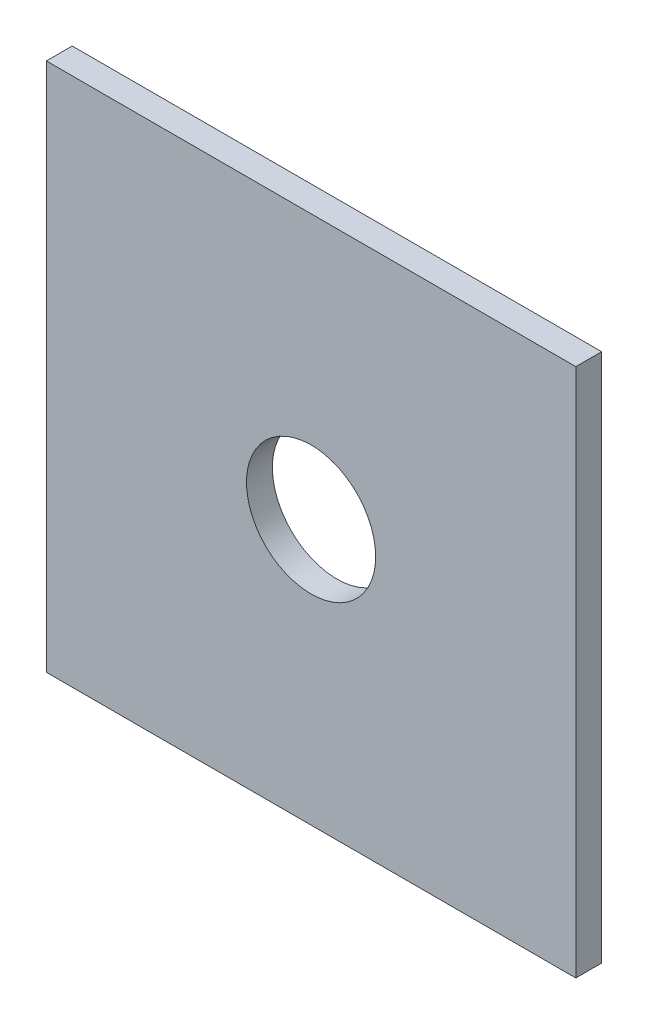
ISO-10303-21;
HEADER;
FILE_DESCRIPTION(('STEP AP214'),'2;1');
FILE_NAME('part.step','',(''),(''),'','','');
FILE_SCHEMA(('AUTOMOTIVE_DESIGN { 1 0 10303 214 1 1 1 1 }'));
ENDSEC;
DATA;
#1=APPLICATION_CONTEXT('core data for automotive mechanical design processes');
#2=APPLICATION_PROTOCOL_DEFINITION('international standard','automotive_design',2000,#1);
#3=PRODUCT_CONTEXT('',#1,'mechanical');
#4=PRODUCT('Part','Part','',(#3));
#5=PRODUCT_RELATED_PRODUCT_CATEGORY('part','',(#4));
#6=PRODUCT_DEFINITION_FORMATION('','',#4);
#7=PRODUCT_DEFINITION_CONTEXT('part definition',#1,'design');
#8=PRODUCT_DEFINITION('design','',#6,#7);
#9=PRODUCT_DEFINITION_SHAPE('','',#8);
#10=(LENGTH_UNIT() NAMED_UNIT(*) SI_UNIT(.MILLI.,.METRE.));
#11=(NAMED_UNIT(*) PLANE_ANGLE_UNIT() SI_UNIT($,.RADIAN.));
#12=(NAMED_UNIT(*) SI_UNIT($,.STERADIAN.) SOLID_ANGLE_UNIT());
#13=UNCERTAINTY_MEASURE_WITH_UNIT(LENGTH_MEASURE(1.E-05),#10,'distance_accuracy_value','');
#14=(GEOMETRIC_REPRESENTATION_CONTEXT(3) GLOBAL_UNCERTAINTY_ASSIGNED_CONTEXT((#13)) GLOBAL_UNIT_ASSIGNED_CONTEXT((#10,
#11,#12)) REPRESENTATION_CONTEXT('',''));
#15=CARTESIAN_POINT('',(0.,0.,0.));
#16=DIRECTION('',(0.,0.,1.));
#17=DIRECTION('',(1.,0.,0.));
#18=AXIS2_PLACEMENT_3D('',#15,#16,#17);
#19=CARTESIAN_POINT('',(75.,-223.,2.));
#20=DIRECTION('',(-1.,0.,0.));
#21=DIRECTION('',(0.,0.,1.));
#22=AXIS2_PLACEMENT_3D('',#19,#20,#21);
#23=PLANE('',#22);
#24=DIRECTION('',(0.,1.,0.));
#25=VECTOR('',#24,1.);
#26=CARTESIAN_POINT('',(75.,-223.,0.));
#27=LINE('',#26,#25);
#28=CARTESIAN_POINT('',(75.,-223.,0.));
#29=VERTEX_POINT('',#28);
#30=CARTESIAN_POINT('',(75.,-182.,0.));
#31=VERTEX_POINT('',#30);
#32=EDGE_CURVE('E96',#29,#31,#27,.T.);
#33=ORIENTED_EDGE('',*,*,#32,.T.);
#34=DIRECTION('',(0.,0.,-1.));
#35=VECTOR('',#34,1.);
#36=CARTESIAN_POINT('',(75.,-182.,2.));
#37=LINE('',#36,#35);
#38=CARTESIAN_POINT('',(75.,-182.,2.));
#39=VERTEX_POINT('',#38);
#40=EDGE_CURVE('E11',#39,#31,#37,.T.);
#41=ORIENTED_EDGE('',*,*,#40,.F.);
#42=DIRECTION('',(0.,1.,0.));
#43=VECTOR('',#42,1.);
#44=CARTESIAN_POINT('',(75.,-223.,2.));
#45=LINE('',#44,#43);
#46=CARTESIAN_POINT('',(75.,-223.,2.));
#47=VERTEX_POINT('',#46);
#48=EDGE_CURVE('E84',#47,#39,#45,.T.);
#49=ORIENTED_EDGE('',*,*,#48,.F.);
#50=DIRECTION('',(0.,0.,-1.));
#51=VECTOR('',#50,1.);
#52=CARTESIAN_POINT('',(75.,-223.,2.));
#53=LINE('',#52,#51);
#54=EDGE_CURVE('E92',#47,#29,#53,.T.);
#55=ORIENTED_EDGE('',*,*,#54,.T.);
#56=EDGE_LOOP('',(#33,#41,#49,#55));
#57=FACE_BOUND('',#56,.T.);
#58=ADVANCED_FACE('F33',(#57),#23,.F.);
#59=CARTESIAN_POINT('',(75.,-182.,2.));
#60=DIRECTION('',(0.,-1.,0.));
#61=DIRECTION('',(0.,0.,-1.));
#62=AXIS2_PLACEMENT_3D('',#59,#60,#61);
#63=PLANE('',#62);
#64=DIRECTION('',(-1.,0.,0.));
#65=VECTOR('',#64,1.);
#66=CARTESIAN_POINT('',(75.,-182.,0.));
#67=LINE('',#66,#65);
#68=CARTESIAN_POINT('',(34.,-182.,0.));
#69=VERTEX_POINT('',#68);
#70=EDGE_CURVE('E88',#31,#69,#67,.T.);
#71=ORIENTED_EDGE('',*,*,#70,.T.);
#72=DIRECTION('',(0.,0.,-1.));
#73=VECTOR('',#72,1.);
#74=CARTESIAN_POINT('',(34.,-182.,2.));
#75=LINE('',#74,#73);
#76=CARTESIAN_POINT('',(34.,-182.,2.));
#77=VERTEX_POINT('',#76);
#78=EDGE_CURVE('E41',#77,#69,#75,.T.);
#79=ORIENTED_EDGE('',*,*,#78,.F.);
#80=DIRECTION('',(-1.,0.,0.));
#81=VECTOR('',#80,1.);
#82=CARTESIAN_POINT('',(75.,-182.,2.));
#83=LINE('',#82,#81);
#84=EDGE_CURVE('E79',#39,#77,#83,.T.);
#85=ORIENTED_EDGE('',*,*,#84,.F.);
#86=ORIENTED_EDGE('',*,*,#40,.T.);
#87=EDGE_LOOP('',(#71,#79,#85,#86));
#88=FACE_BOUND('',#87,.T.);
#89=ADVANCED_FACE('F87',(#88),#63,.F.);
#90=CARTESIAN_POINT('',(34.,-223.,2.));
#91=DIRECTION('',(1.,0.,0.));
#92=DIRECTION('',(0.,0.,-1.));
#93=AXIS2_PLACEMENT_3D('',#90,#91,#92);
#94=PLANE('',#93);
#95=DIRECTION('',(0.,-1.,0.));
#96=VECTOR('',#95,1.);
#97=CARTESIAN_POINT('',(34.,-223.,0.));
#98=LINE('',#97,#96);
#99=CARTESIAN_POINT('',(34.,-223.,0.));
#100=VERTEX_POINT('',#99);
#101=EDGE_CURVE('E66',#69,#100,#98,.T.);
#102=ORIENTED_EDGE('',*,*,#101,.T.);
#103=DIRECTION('',(0.,0.,-1.));
#104=VECTOR('',#103,1.);
#105=CARTESIAN_POINT('',(34.,-223.,2.));
#106=LINE('',#105,#104);
#107=CARTESIAN_POINT('',(34.,-223.,2.));
#108=VERTEX_POINT('',#107);
#109=EDGE_CURVE('E89',#108,#100,#106,.T.);
#110=ORIENTED_EDGE('',*,*,#109,.F.);
#111=DIRECTION('',(0.,-1.,0.));
#112=VECTOR('',#111,1.);
#113=CARTESIAN_POINT('',(34.,-223.,2.));
#114=LINE('',#113,#112);
#115=EDGE_CURVE('E82',#77,#108,#114,.T.);
#116=ORIENTED_EDGE('',*,*,#115,.F.);
#117=ORIENTED_EDGE('',*,*,#78,.T.);
#118=EDGE_LOOP('',(#102,#110,#116,#117));
#119=FACE_BOUND('',#118,.T.);
#120=ADVANCED_FACE('F90',(#119),#94,.F.);
#121=CARTESIAN_POINT('',(75.,-223.,2.));
#122=DIRECTION('',(0.,1.,0.));
#123=DIRECTION('',(0.,0.,1.));
#124=AXIS2_PLACEMENT_3D('',#121,#122,#123);
#125=PLANE('',#124);
#126=DIRECTION('',(1.,0.,0.));
#127=VECTOR('',#126,1.);
#128=CARTESIAN_POINT('',(75.,-223.,0.));
#129=LINE('',#128,#127);
#130=EDGE_CURVE('E72',#100,#29,#129,.T.);
#131=ORIENTED_EDGE('',*,*,#130,.T.);
#132=ORIENTED_EDGE('',*,*,#54,.F.);
#133=DIRECTION('',(1.,0.,0.));
#134=VECTOR('',#133,1.);
#135=CARTESIAN_POINT('',(75.,-223.,2.));
#136=LINE('',#135,#134);
#137=EDGE_CURVE('E49',#108,#47,#136,.T.);
#138=ORIENTED_EDGE('',*,*,#137,.F.);
#139=ORIENTED_EDGE('',*,*,#109,.T.);
#140=EDGE_LOOP('',(#131,#132,#138,#139));
#141=FACE_BOUND('',#140,.T.);
#142=ADVANCED_FACE('F104',(#141),#125,.F.);
#143=CARTESIAN_POINT('',(0.,0.,2.));
#144=DIRECTION('',(0.,0.,1.));
#145=DIRECTION('',(1.,0.,0.));
#146=AXIS2_PLACEMENT_3D('',#143,#144,#145);
#147=PLANE('',#146);
#148=CARTESIAN_POINT('',(54.5,-202.5,2.));
#149=DIRECTION('',(0.,0.,1.));
#150=DIRECTION('',(1.,0.,0.));
#151=AXIS2_PLACEMENT_3D('',#148,#149,#150);
#152=CIRCLE('',#151,5.);
#153=CARTESIAN_POINT('',(59.5,-202.5,2.));
#154=VERTEX_POINT('',#153);
#155=EDGE_CURVE('E99',#154,#154,#152,.T.);
#156=ORIENTED_EDGE('',*,*,#155,.F.);
#157=EDGE_LOOP('',(#156));
#158=FACE_BOUND('',#157,.T.);
#159=ORIENTED_EDGE('',*,*,#48,.T.);
#160=ORIENTED_EDGE('',*,*,#84,.T.);
#161=ORIENTED_EDGE('',*,*,#115,.T.);
#162=ORIENTED_EDGE('',*,*,#137,.T.);
#163=EDGE_LOOP('',(#159,#160,#161,#162));
#164=FACE_BOUND('',#163,.T.);
#165=ADVANCED_FACE('F80',(#158,#164),#147,.T.);
#166=CARTESIAN_POINT('',(0.,0.,0.));
#167=DIRECTION('',(0.,0.,1.));
#168=DIRECTION('',(1.,0.,0.));
#169=AXIS2_PLACEMENT_3D('',#166,#167,#168);
#170=PLANE('',#169);
#171=CARTESIAN_POINT('',(54.5,-202.5,0.));
#172=DIRECTION('',(0.,0.,1.));
#173=DIRECTION('',(1.,0.,0.));
#174=AXIS2_PLACEMENT_3D('',#171,#172,#173);
#175=CIRCLE('',#174,5.);
#176=CARTESIAN_POINT('',(59.5,-202.5,0.));
#177=VERTEX_POINT('',#176);
#178=EDGE_CURVE('E110',#177,#177,#175,.T.);
#179=ORIENTED_EDGE('',*,*,#178,.T.);
#180=EDGE_LOOP('',(#179));
#181=FACE_BOUND('',#180,.T.);
#182=ORIENTED_EDGE('',*,*,#32,.F.);
#183=ORIENTED_EDGE('',*,*,#130,.F.);
#184=ORIENTED_EDGE('',*,*,#101,.F.);
#185=ORIENTED_EDGE('',*,*,#70,.F.);
#186=EDGE_LOOP('',(#182,#183,#184,#185));
#187=FACE_BOUND('',#186,.T.);
#188=ADVANCED_FACE('F107',(#181,#187),#170,.F.);
#189=CARTESIAN_POINT('',(54.5,-202.5,2.));
#190=DIRECTION('',(0.,0.,-1.));
#191=DIRECTION('',(-1.,0.,0.));
#192=AXIS2_PLACEMENT_3D('',#189,#190,#191);
#193=CYLINDRICAL_SURFACE('',#192,5.);
#194=ORIENTED_EDGE('',*,*,#155,.T.);
#195=EDGE_LOOP('',(#194));
#196=FACE_BOUND('',#195,.T.);
#197=ORIENTED_EDGE('',*,*,#178,.F.);
#198=EDGE_LOOP('',(#197));
#199=FACE_BOUND('',#198,.T.);
#200=ADVANCED_FACE('F116',(#196,#199),#193,.F.);
#201=CLOSED_SHELL('',(#58,#89,#120,#142,#165,#188,#200));
#202=MANIFOLD_SOLID_BREP('B2',#201);
#203=ADVANCED_BREP_SHAPE_REPRESENTATION('',(#18,#202),#14);
#204=SHAPE_DEFINITION_REPRESENTATION(#9,#203);
ENDSEC;
END-ISO-10303-21;
